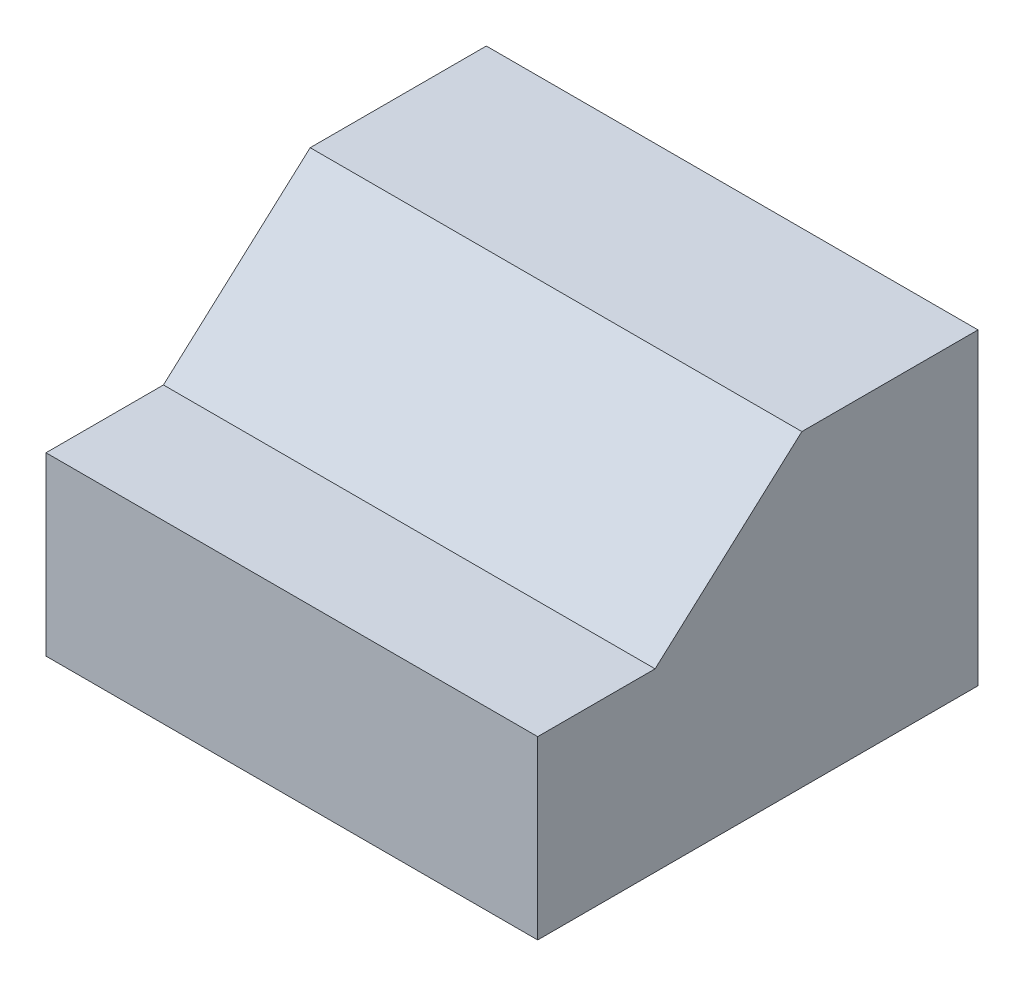
ISO-10303-21;
HEADER;
FILE_DESCRIPTION(('STEP AP214'),'2;1');
FILE_NAME('part.step','',(''),(''),'','','');
FILE_SCHEMA(('AUTOMOTIVE_DESIGN { 1 0 10303 214 1 1 1 1 }'));
ENDSEC;
DATA;
#1=APPLICATION_CONTEXT('core data for automotive mechanical design processes');
#2=APPLICATION_PROTOCOL_DEFINITION('international standard','automotive_design',2000,#1);
#3=PRODUCT_CONTEXT('',#1,'mechanical');
#4=PRODUCT('Part','Part','',(#3));
#5=PRODUCT_RELATED_PRODUCT_CATEGORY('part','',(#4));
#6=PRODUCT_DEFINITION_FORMATION('','',#4);
#7=PRODUCT_DEFINITION_CONTEXT('part definition',#1,'design');
#8=PRODUCT_DEFINITION('design','',#6,#7);
#9=PRODUCT_DEFINITION_SHAPE('','',#8);
#10=(LENGTH_UNIT() NAMED_UNIT(*) SI_UNIT(.MILLI.,.METRE.));
#11=(NAMED_UNIT(*) PLANE_ANGLE_UNIT() SI_UNIT($,.RADIAN.));
#12=(NAMED_UNIT(*) SI_UNIT($,.STERADIAN.) SOLID_ANGLE_UNIT());
#13=UNCERTAINTY_MEASURE_WITH_UNIT(LENGTH_MEASURE(1.E-05),#10,'distance_accuracy_value','');
#14=(GEOMETRIC_REPRESENTATION_CONTEXT(3) GLOBAL_UNCERTAINTY_ASSIGNED_CONTEXT((#13)) GLOBAL_UNIT_ASSIGNED_CONTEXT((#10,
#11,#12)) REPRESENTATION_CONTEXT('',''));
#15=CARTESIAN_POINT('',(0.,0.,0.));
#16=DIRECTION('',(0.,0.,1.));
#17=DIRECTION('',(1.,0.,0.));
#18=AXIS2_PLACEMENT_3D('',#15,#16,#17);
#19=CARTESIAN_POINT('',(850.9,457.2,-507.999999999999));
#20=DIRECTION('',(0.,-0.743294146247166,-0.66896473162245));
#21=DIRECTION('',(0.,0.66896473162245,-0.743294146247166));
#22=AXIS2_PLACEMENT_3D('',#19,#20,#21);
#23=PLANE('',#22);
#24=DIRECTION('',(0.,-0.66896473162245,0.743294146247166));
#25=VECTOR('',#24,1.);
#26=CARTESIAN_POINT('',(-850.9,457.2,-507.999999999999));
#27=LINE('',#26,#25);
#28=CARTESIAN_POINT('',(-850.9,457.2,-507.999999999999));
#29=VERTEX_POINT('',#28);
#30=CARTESIAN_POINT('',(-850.9,0.,0.));
#31=VERTEX_POINT('',#30);
#32=EDGE_CURVE('E134',#29,#31,#27,.T.);
#33=ORIENTED_EDGE('',*,*,#32,.T.);
#34=DIRECTION('',(-1.,0.,0.));
#35=VECTOR('',#34,1.);
#36=CARTESIAN_POINT('',(850.9,0.,0.));
#37=LINE('',#36,#35);
#38=CARTESIAN_POINT('',(850.9,0.,0.));
#39=VERTEX_POINT('',#38);
#40=EDGE_CURVE('E11',#39,#31,#37,.T.);
#41=ORIENTED_EDGE('',*,*,#40,.F.);
#42=DIRECTION('',(0.,-0.66896473162245,0.743294146247166));
#43=VECTOR('',#42,1.);
#44=CARTESIAN_POINT('',(850.9,457.2,-507.999999999999));
#45=LINE('',#44,#43);
#46=CARTESIAN_POINT('',(850.9,457.2,-507.999999999999));
#47=VERTEX_POINT('',#46);
#48=EDGE_CURVE('E150',#47,#39,#45,.T.);
#49=ORIENTED_EDGE('',*,*,#48,.F.);
#50=DIRECTION('',(-1.,0.,0.));
#51=VECTOR('',#50,1.);
#52=CARTESIAN_POINT('',(850.9,457.2,-507.999999999999));
#53=LINE('',#52,#51);
#54=EDGE_CURVE('E130',#47,#29,#53,.T.);
#55=ORIENTED_EDGE('',*,*,#54,.T.);
#56=EDGE_LOOP('',(#33,#41,#49,#55));
#57=FACE_BOUND('',#56,.T.);
#58=ADVANCED_FACE('F45',(#57),#23,.F.);
#59=CARTESIAN_POINT('',(850.9,0.,0.));
#60=DIRECTION('',(0.,-1.,0.));
#61=DIRECTION('',(0.,0.,-1.));
#62=AXIS2_PLACEMENT_3D('',#59,#60,#61);
#63=PLANE('',#62);
#64=DIRECTION('',(0.,0.,1.));
#65=VECTOR('',#64,1.);
#66=CARTESIAN_POINT('',(-850.9,0.,0.));
#67=LINE('',#66,#65);
#68=CARTESIAN_POINT('',(-850.9,0.,406.4));
#69=VERTEX_POINT('',#68);
#70=EDGE_CURVE('E138',#31,#69,#67,.T.);
#71=ORIENTED_EDGE('',*,*,#70,.T.);
#72=DIRECTION('',(-1.,0.,0.));
#73=VECTOR('',#72,1.);
#74=CARTESIAN_POINT('',(850.9,0.,406.4));
#75=LINE('',#74,#73);
#76=CARTESIAN_POINT('',(850.9,0.,406.4));
#77=VERTEX_POINT('',#76);
#78=EDGE_CURVE('E54',#77,#69,#75,.T.);
#79=ORIENTED_EDGE('',*,*,#78,.F.);
#80=DIRECTION('',(0.,0.,1.));
#81=VECTOR('',#80,1.);
#82=CARTESIAN_POINT('',(850.9,0.,0.));
#83=LINE('',#82,#81);
#84=EDGE_CURVE('E99',#39,#77,#83,.T.);
#85=ORIENTED_EDGE('',*,*,#84,.F.);
#86=ORIENTED_EDGE('',*,*,#40,.T.);
#87=EDGE_LOOP('',(#71,#79,#85,#86));
#88=FACE_BOUND('',#87,.T.);
#89=ADVANCED_FACE('F178',(#88),#63,.F.);
#90=CARTESIAN_POINT('',(850.9,0.,406.4));
#91=DIRECTION('',(0.,0.,-1.));
#92=DIRECTION('',(0.,1.,0.));
#93=AXIS2_PLACEMENT_3D('',#90,#91,#92);
#94=PLANE('',#93);
#95=DIRECTION('',(0.,-1.,0.));
#96=VECTOR('',#95,1.);
#97=CARTESIAN_POINT('',(-850.9,0.,406.4));
#98=LINE('',#97,#96);
#99=CARTESIAN_POINT('',(-850.9,-609.6,406.4));
#100=VERTEX_POINT('',#99);
#101=EDGE_CURVE('E141',#69,#100,#98,.T.);
#102=ORIENTED_EDGE('',*,*,#101,.T.);
#103=DIRECTION('',(-1.,0.,0.));
#104=VECTOR('',#103,1.);
#105=CARTESIAN_POINT('',(850.9,-609.6,406.4));
#106=LINE('',#105,#104);
#107=CARTESIAN_POINT('',(850.9,-609.6,406.4));
#108=VERTEX_POINT('',#107);
#109=EDGE_CURVE('E123',#108,#100,#106,.T.);
#110=ORIENTED_EDGE('',*,*,#109,.F.);
#111=DIRECTION('',(0.,-1.,0.));
#112=VECTOR('',#111,1.);
#113=CARTESIAN_POINT('',(850.9,0.,406.4));
#114=LINE('',#113,#112);
#115=EDGE_CURVE('E112',#77,#108,#114,.T.);
#116=ORIENTED_EDGE('',*,*,#115,.F.);
#117=ORIENTED_EDGE('',*,*,#78,.T.);
#118=EDGE_LOOP('',(#102,#110,#116,#117));
#119=FACE_BOUND('',#118,.T.);
#120=ADVANCED_FACE('F160',(#119),#94,.F.);
#121=CARTESIAN_POINT('',(850.9,-609.6,406.4));
#122=DIRECTION('',(0.,1.,0.));
#123=DIRECTION('',(0.,0.,1.));
#124=AXIS2_PLACEMENT_3D('',#121,#122,#123);
#125=PLANE('',#124);
#126=DIRECTION('',(0.,0.,-1.));
#127=VECTOR('',#126,1.);
#128=CARTESIAN_POINT('',(-850.9,-609.6,406.4));
#129=LINE('',#128,#127);
#130=CARTESIAN_POINT('',(-850.9,-609.6,-1117.6));
#131=VERTEX_POINT('',#130);
#132=EDGE_CURVE('E121',#100,#131,#129,.T.);
#133=ORIENTED_EDGE('',*,*,#132,.T.);
#134=DIRECTION('',(-1.,0.,0.));
#135=VECTOR('',#134,1.);
#136=CARTESIAN_POINT('',(850.9,-609.6,-1117.6));
#137=LINE('',#136,#135);
#138=CARTESIAN_POINT('',(850.9,-609.6,-1117.6));
#139=VERTEX_POINT('',#138);
#140=EDGE_CURVE('E118',#139,#131,#137,.T.);
#141=ORIENTED_EDGE('',*,*,#140,.F.);
#142=DIRECTION('',(0.,0.,-1.));
#143=VECTOR('',#142,1.);
#144=CARTESIAN_POINT('',(850.9,-609.6,406.4));
#145=LINE('',#144,#143);
#146=EDGE_CURVE('E106',#108,#139,#145,.T.);
#147=ORIENTED_EDGE('',*,*,#146,.F.);
#148=ORIENTED_EDGE('',*,*,#109,.T.);
#149=EDGE_LOOP('',(#133,#141,#147,#148));
#150=FACE_BOUND('',#149,.T.);
#151=ADVANCED_FACE('F119',(#150),#125,.F.);
#152=CARTESIAN_POINT('',(850.9,-609.6,-1117.6));
#153=DIRECTION('',(0.,0.,1.));
#154=DIRECTION('',(1.,0.,0.));
#155=AXIS2_PLACEMENT_3D('',#152,#153,#154);
#156=PLANE('',#155);
#157=DIRECTION('',(0.,1.,0.));
#158=VECTOR('',#157,1.);
#159=CARTESIAN_POINT('',(-850.9,-609.6,-1117.6));
#160=LINE('',#159,#158);
#161=CARTESIAN_POINT('',(-850.9,457.2,-1117.6));
#162=VERTEX_POINT('',#161);
#163=EDGE_CURVE('E85',#131,#162,#160,.T.);
#164=ORIENTED_EDGE('',*,*,#163,.T.);
#165=DIRECTION('',(-1.,0.,0.));
#166=VECTOR('',#165,1.);
#167=CARTESIAN_POINT('',(850.9,457.2,-1117.6));
#168=LINE('',#167,#166);
#169=CARTESIAN_POINT('',(850.9,457.2,-1117.6));
#170=VERTEX_POINT('',#169);
#171=EDGE_CURVE('E124',#170,#162,#168,.T.);
#172=ORIENTED_EDGE('',*,*,#171,.F.);
#173=DIRECTION('',(0.,1.,0.));
#174=VECTOR('',#173,1.);
#175=CARTESIAN_POINT('',(850.9,-609.6,-1117.6));
#176=LINE('',#175,#174);
#177=EDGE_CURVE('E110',#139,#170,#176,.T.);
#178=ORIENTED_EDGE('',*,*,#177,.F.);
#179=ORIENTED_EDGE('',*,*,#140,.T.);
#180=EDGE_LOOP('',(#164,#172,#178,#179));
#181=FACE_BOUND('',#180,.T.);
#182=ADVANCED_FACE('F126',(#181),#156,.F.);
#183=CARTESIAN_POINT('',(850.9,457.2,-1117.6));
#184=DIRECTION('',(0.,-1.,0.));
#185=DIRECTION('',(0.,0.,-1.));
#186=AXIS2_PLACEMENT_3D('',#183,#184,#185);
#187=PLANE('',#186);
#188=DIRECTION('',(0.,0.,1.));
#189=VECTOR('',#188,1.);
#190=CARTESIAN_POINT('',(-850.9,457.2,-1117.6));
#191=LINE('',#190,#189);
#192=EDGE_CURVE('E91',#162,#29,#191,.T.);
#193=ORIENTED_EDGE('',*,*,#192,.T.);
#194=ORIENTED_EDGE('',*,*,#54,.F.);
#195=DIRECTION('',(0.,0.,1.));
#196=VECTOR('',#195,1.);
#197=CARTESIAN_POINT('',(850.9,457.2,-1117.6));
#198=LINE('',#197,#196);
#199=EDGE_CURVE('E62',#170,#47,#198,.T.);
#200=ORIENTED_EDGE('',*,*,#199,.F.);
#201=ORIENTED_EDGE('',*,*,#171,.T.);
#202=EDGE_LOOP('',(#193,#194,#200,#201));
#203=FACE_BOUND('',#202,.T.);
#204=ADVANCED_FACE('F167',(#203),#187,.F.);
#205=CARTESIAN_POINT('',(850.9,0.,0.));
#206=DIRECTION('',(1.,0.,0.));
#207=DIRECTION('',(0.,0.,-1.));
#208=AXIS2_PLACEMENT_3D('',#205,#206,#207);
#209=PLANE('',#208);
#210=ORIENTED_EDGE('',*,*,#48,.T.);
#211=ORIENTED_EDGE('',*,*,#84,.T.);
#212=ORIENTED_EDGE('',*,*,#115,.T.);
#213=ORIENTED_EDGE('',*,*,#146,.T.);
#214=ORIENTED_EDGE('',*,*,#177,.T.);
#215=ORIENTED_EDGE('',*,*,#199,.T.);
#216=EDGE_LOOP('',(#210,#211,#212,#213,#214,#215));
#217=FACE_BOUND('',#216,.T.);
#218=ADVANCED_FACE('F108',(#217),#209,.T.);
#219=CARTESIAN_POINT('',(-850.9,0.,0.));
#220=DIRECTION('',(1.,0.,0.));
#221=DIRECTION('',(0.,0.,-1.));
#222=AXIS2_PLACEMENT_3D('',#219,#220,#221);
#223=PLANE('',#222);
#224=ORIENTED_EDGE('',*,*,#32,.F.);
#225=ORIENTED_EDGE('',*,*,#192,.F.);
#226=ORIENTED_EDGE('',*,*,#163,.F.);
#227=ORIENTED_EDGE('',*,*,#132,.F.);
#228=ORIENTED_EDGE('',*,*,#101,.F.);
#229=ORIENTED_EDGE('',*,*,#70,.F.);
#230=EDGE_LOOP('',(#224,#225,#226,#227,#228,#229));
#231=FACE_BOUND('',#230,.T.);
#232=ADVANCED_FACE('F163',(#231),#223,.F.);
#233=CLOSED_SHELL('',(#58,#89,#120,#151,#182,#204,#218,#232));
#234=MANIFOLD_SOLID_BREP('B2',#233);
#235=ADVANCED_BREP_SHAPE_REPRESENTATION('',(#18,#234),#14);
#236=SHAPE_DEFINITION_REPRESENTATION(#9,#235);
ENDSEC;
END-ISO-10303-21;
